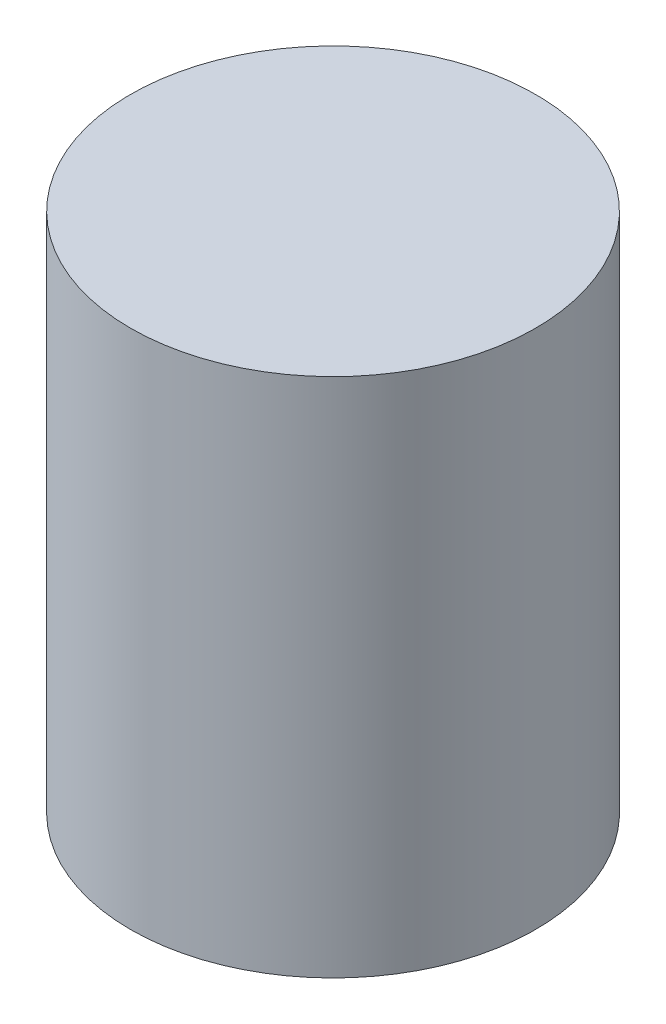
ISO-10303-21;
HEADER;
FILE_DESCRIPTION(('STEP AP214'),'2;1');
FILE_NAME('part.step','',(''),(''),'','','');
FILE_SCHEMA(('AUTOMOTIVE_DESIGN { 1 0 10303 214 1 1 1 1 }'));
ENDSEC;
DATA;
#1=APPLICATION_CONTEXT('core data for automotive mechanical design processes');
#2=APPLICATION_PROTOCOL_DEFINITION('international standard','automotive_design',2000,#1);
#3=PRODUCT_CONTEXT('',#1,'mechanical');
#4=PRODUCT('Part','Part','',(#3));
#5=PRODUCT_RELATED_PRODUCT_CATEGORY('part','',(#4));
#6=PRODUCT_DEFINITION_FORMATION('','',#4);
#7=PRODUCT_DEFINITION_CONTEXT('part definition',#1,'design');
#8=PRODUCT_DEFINITION('design','',#6,#7);
#9=PRODUCT_DEFINITION_SHAPE('','',#8);
#10=(LENGTH_UNIT() NAMED_UNIT(*) SI_UNIT(.MILLI.,.METRE.));
#11=(NAMED_UNIT(*) PLANE_ANGLE_UNIT() SI_UNIT($,.RADIAN.));
#12=(NAMED_UNIT(*) SI_UNIT($,.STERADIAN.) SOLID_ANGLE_UNIT());
#13=UNCERTAINTY_MEASURE_WITH_UNIT(LENGTH_MEASURE(1.E-05),#10,'distance_accuracy_value','');
#14=(GEOMETRIC_REPRESENTATION_CONTEXT(3) GLOBAL_UNCERTAINTY_ASSIGNED_CONTEXT((#13)) GLOBAL_UNIT_ASSIGNED_CONTEXT((#10,
#11,#12)) REPRESENTATION_CONTEXT('',''));
#15=CARTESIAN_POINT('',(0.,0.,0.));
#16=DIRECTION('',(0.,0.,1.));
#17=DIRECTION('',(1.,0.,0.));
#18=AXIS2_PLACEMENT_3D('',#15,#16,#17);
#19=CARTESIAN_POINT('',(0.,45.,0.));
#20=DIRECTION('',(0.,-1.,0.));
#21=DIRECTION('',(0.,0.,-1.));
#22=AXIS2_PLACEMENT_3D('',#19,#20,#21);
#23=CYLINDRICAL_SURFACE('',#22,17.5);
#24=CARTESIAN_POINT('',(0.,45.,0.));
#25=DIRECTION('',(0.,1.,0.));
#26=DIRECTION('',(0.,0.,1.));
#27=AXIS2_PLACEMENT_3D('',#24,#25,#26);
#28=CIRCLE('',#27,17.5);
#29=CARTESIAN_POINT('',(0.,45.,17.5));
#30=VERTEX_POINT('',#29);
#31=EDGE_CURVE('E10',#30,#30,#28,.T.);
#32=ORIENTED_EDGE('',*,*,#31,.F.);
#33=EDGE_LOOP('',(#32));
#34=FACE_BOUND('',#33,.T.);
#35=CARTESIAN_POINT('',(0.,0.,0.));
#36=DIRECTION('',(0.,1.,0.));
#37=DIRECTION('',(0.,0.,1.));
#38=AXIS2_PLACEMENT_3D('',#35,#36,#37);
#39=CIRCLE('',#38,17.5);
#40=CARTESIAN_POINT('',(0.,0.,17.5));
#41=VERTEX_POINT('',#40);
#42=EDGE_CURVE('E34',#41,#41,#39,.T.);
#43=ORIENTED_EDGE('',*,*,#42,.T.);
#44=EDGE_LOOP('',(#43));
#45=FACE_BOUND('',#44,.T.);
#46=ADVANCED_FACE('F31',(#34,#45),#23,.T.);
#47=CARTESIAN_POINT('',(0.,45.,0.));
#48=DIRECTION('',(0.,1.,0.));
#49=DIRECTION('',(0.,0.,1.));
#50=AXIS2_PLACEMENT_3D('',#47,#48,#49);
#51=PLANE('',#50);
#52=ORIENTED_EDGE('',*,*,#31,.T.);
#53=EDGE_LOOP('',(#52));
#54=FACE_BOUND('',#53,.T.);
#55=ADVANCED_FACE('F46',(#54),#51,.T.);
#56=CARTESIAN_POINT('',(0.,0.,0.));
#57=DIRECTION('',(0.,1.,0.));
#58=DIRECTION('',(0.,0.,1.));
#59=AXIS2_PLACEMENT_3D('',#56,#57,#58);
#60=PLANE('',#59);
#61=ORIENTED_EDGE('',*,*,#42,.F.);
#62=EDGE_LOOP('',(#61));
#63=FACE_BOUND('',#62,.T.);
#64=ADVANCED_FACE('F44',(#63),#60,.F.);
#65=CLOSED_SHELL('',(#46,#55,#64));
#66=MANIFOLD_SOLID_BREP('B2',#65);
#67=ADVANCED_BREP_SHAPE_REPRESENTATION('',(#18,#66),#14);
#68=SHAPE_DEFINITION_REPRESENTATION(#9,#67);
ENDSEC;
END-ISO-10303-21;
